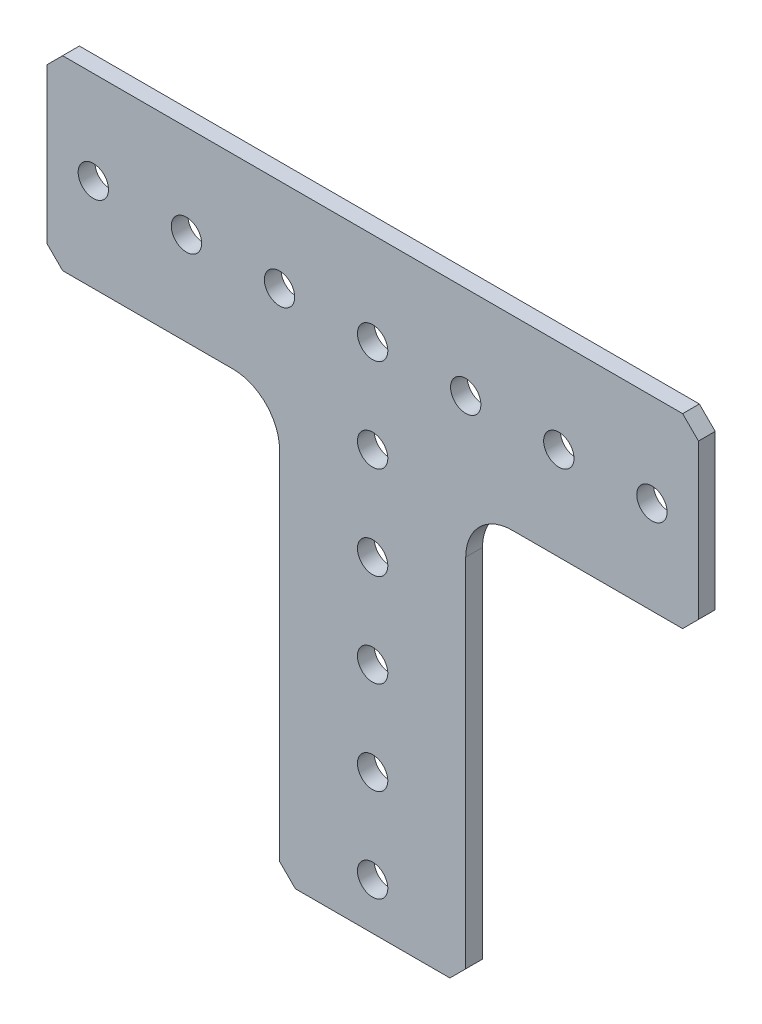
ISO-10303-21;
HEADER;
FILE_DESCRIPTION(('STEP AP214'),'2;1');
FILE_NAME('part.step','',(''),(''),'','','');
FILE_SCHEMA(('AUTOMOTIVE_DESIGN { 1 0 10303 214 1 1 1 1 }'));
ENDSEC;
DATA;
#1=APPLICATION_CONTEXT('core data for automotive mechanical design processes');
#2=APPLICATION_PROTOCOL_DEFINITION('international standard','automotive_design',2000,#1);
#3=PRODUCT_CONTEXT('',#1,'mechanical');
#4=PRODUCT('Part','Part','',(#3));
#5=PRODUCT_RELATED_PRODUCT_CATEGORY('part','',(#4));
#6=PRODUCT_DEFINITION_FORMATION('','',#4);
#7=PRODUCT_DEFINITION_CONTEXT('part definition',#1,'design');
#8=PRODUCT_DEFINITION('design','',#6,#7);
#9=PRODUCT_DEFINITION_SHAPE('','',#8);
#10=(LENGTH_UNIT() NAMED_UNIT(*) SI_UNIT(.MILLI.,.METRE.));
#11=(NAMED_UNIT(*) PLANE_ANGLE_UNIT() SI_UNIT($,.RADIAN.));
#12=(NAMED_UNIT(*) SI_UNIT($,.STERADIAN.) SOLID_ANGLE_UNIT());
#13=UNCERTAINTY_MEASURE_WITH_UNIT(LENGTH_MEASURE(1.E-05),#10,'distance_accuracy_value','');
#14=(GEOMETRIC_REPRESENTATION_CONTEXT(3) GLOBAL_UNCERTAINTY_ASSIGNED_CONTEXT((#13)) GLOBAL_UNIT_ASSIGNED_CONTEXT((#10,
#11,#12)) REPRESENTATION_CONTEXT('',''));
#15=CARTESIAN_POINT('',(0.,0.,0.));
#16=DIRECTION('',(0.,0.,1.));
#17=DIRECTION('',(1.,0.,0.));
#18=AXIS2_PLACEMENT_3D('',#15,#16,#17);
#19=CARTESIAN_POINT('',(44.45,-57.15,2.286));
#20=DIRECTION('',(0.,0.,1.));
#21=DIRECTION('',(1.,0.,0.));
#22=AXIS2_PLACEMENT_3D('',#19,#20,#21);
#23=PLANE('',#22);
#24=CARTESIAN_POINT('',(0.,-38.1,2.286));
#25=DIRECTION('',(0.,0.,-1.));
#26=DIRECTION('',(-1.,0.,0.));
#27=AXIS2_PLACEMENT_3D('',#24,#25,#26);
#28=CIRCLE('',#27,2.0701);
#29=CARTESIAN_POINT('',(-2.0701,-38.1,2.286));
#30=VERTEX_POINT('',#29);
#31=EDGE_CURVE('E222',#30,#30,#28,.T.);
#32=ORIENTED_EDGE('',*,*,#31,.T.);
#33=EDGE_LOOP('',(#32));
#34=FACE_BOUND('',#33,.T.);
#35=CARTESIAN_POINT('',(0.,-12.7,2.286));
#36=DIRECTION('',(0.,0.,-1.));
#37=DIRECTION('',(-1.,0.,0.));
#38=AXIS2_PLACEMENT_3D('',#35,#36,#37);
#39=CIRCLE('',#38,2.0701);
#40=CARTESIAN_POINT('',(-2.0701,-12.7,2.286));
#41=VERTEX_POINT('',#40);
#42=EDGE_CURVE('E321',#41,#41,#39,.T.);
#43=ORIENTED_EDGE('',*,*,#42,.T.);
#44=EDGE_LOOP('',(#43));
#45=FACE_BOUND('',#44,.T.);
#46=CARTESIAN_POINT('',(38.1,12.7,2.286));
#47=DIRECTION('',(0.,0.,-1.));
#48=DIRECTION('',(-1.,0.,0.));
#49=AXIS2_PLACEMENT_3D('',#46,#47,#48);
#50=CIRCLE('',#49,2.0701);
#51=CARTESIAN_POINT('',(36.0299,12.7,2.286));
#52=VERTEX_POINT('',#51);
#53=EDGE_CURVE('E324',#52,#52,#50,.T.);
#54=ORIENTED_EDGE('',*,*,#53,.T.);
#55=EDGE_LOOP('',(#54));
#56=FACE_BOUND('',#55,.T.);
#57=CARTESIAN_POINT('',(12.7,12.7,2.286));
#58=DIRECTION('',(0.,0.,-1.));
#59=DIRECTION('',(-1.,0.,0.));
#60=AXIS2_PLACEMENT_3D('',#57,#58,#59);
#61=CIRCLE('',#60,2.0701);
#62=CARTESIAN_POINT('',(10.6299,12.7,2.286));
#63=VERTEX_POINT('',#62);
#64=EDGE_CURVE('E327',#63,#63,#61,.T.);
#65=ORIENTED_EDGE('',*,*,#64,.T.);
#66=EDGE_LOOP('',(#65));
#67=FACE_BOUND('',#66,.T.);
#68=CARTESIAN_POINT('',(-12.7,12.7,2.286));
#69=DIRECTION('',(0.,0.,-1.));
#70=DIRECTION('',(-1.,0.,0.));
#71=AXIS2_PLACEMENT_3D('',#68,#69,#70);
#72=CIRCLE('',#71,2.0701);
#73=CARTESIAN_POINT('',(-14.7701,12.7,2.286));
#74=VERTEX_POINT('',#73);
#75=EDGE_CURVE('E330',#74,#74,#72,.T.);
#76=ORIENTED_EDGE('',*,*,#75,.T.);
#77=EDGE_LOOP('',(#76));
#78=FACE_BOUND('',#77,.T.);
#79=CARTESIAN_POINT('',(-38.1,12.7,2.286));
#80=DIRECTION('',(0.,0.,-1.));
#81=DIRECTION('',(-1.,0.,0.));
#82=AXIS2_PLACEMENT_3D('',#79,#80,#81);
#83=CIRCLE('',#82,2.0701);
#84=CARTESIAN_POINT('',(-40.1701,12.7,2.286));
#85=VERTEX_POINT('',#84);
#86=EDGE_CURVE('E333',#85,#85,#83,.T.);
#87=ORIENTED_EDGE('',*,*,#86,.T.);
#88=EDGE_LOOP('',(#87));
#89=FACE_BOUND('',#88,.T.);
#90=CARTESIAN_POINT('',(-25.4,12.7,2.286));
#91=DIRECTION('',(0.,0.,-1.));
#92=DIRECTION('',(-1.,0.,0.));
#93=AXIS2_PLACEMENT_3D('',#90,#91,#92);
#94=CIRCLE('',#93,2.0701);
#95=CARTESIAN_POINT('',(-27.4701,12.7,2.286));
#96=VERTEX_POINT('',#95);
#97=EDGE_CURVE('E336',#96,#96,#94,.T.);
#98=ORIENTED_EDGE('',*,*,#97,.T.);
#99=EDGE_LOOP('',(#98));
#100=FACE_BOUND('',#99,.T.);
#101=CARTESIAN_POINT('',(0.,12.7,2.286));
#102=DIRECTION('',(0.,0.,-1.));
#103=DIRECTION('',(-1.,0.,0.));
#104=AXIS2_PLACEMENT_3D('',#101,#102,#103);
#105=CIRCLE('',#104,2.0701);
#106=CARTESIAN_POINT('',(-2.0701,12.7,2.286));
#107=VERTEX_POINT('',#106);
#108=EDGE_CURVE('E339',#107,#107,#105,.T.);
#109=ORIENTED_EDGE('',*,*,#108,.T.);
#110=EDGE_LOOP('',(#109));
#111=FACE_BOUND('',#110,.T.);
#112=CARTESIAN_POINT('',(25.4,12.7,2.286));
#113=DIRECTION('',(0.,0.,-1.));
#114=DIRECTION('',(-1.,0.,0.));
#115=AXIS2_PLACEMENT_3D('',#112,#113,#114);
#116=CIRCLE('',#115,2.0701);
#117=CARTESIAN_POINT('',(23.3299,12.7,2.286));
#118=VERTEX_POINT('',#117);
#119=EDGE_CURVE('E342',#118,#118,#116,.T.);
#120=ORIENTED_EDGE('',*,*,#119,.T.);
#121=EDGE_LOOP('',(#120));
#122=FACE_BOUND('',#121,.T.);
#123=CARTESIAN_POINT('',(0.,0.,2.286));
#124=DIRECTION('',(0.,0.,-1.));
#125=DIRECTION('',(-1.,0.,0.));
#126=AXIS2_PLACEMENT_3D('',#123,#124,#125);
#127=CIRCLE('',#126,2.0701);
#128=CARTESIAN_POINT('',(-2.0701,0.,2.286));
#129=VERTEX_POINT('',#128);
#130=EDGE_CURVE('E345',#129,#129,#127,.T.);
#131=ORIENTED_EDGE('',*,*,#130,.T.);
#132=EDGE_LOOP('',(#131));
#133=FACE_BOUND('',#132,.T.);
#134=CARTESIAN_POINT('',(0.,-25.4,2.286));
#135=DIRECTION('',(0.,0.,-1.));
#136=DIRECTION('',(-1.,0.,0.));
#137=AXIS2_PLACEMENT_3D('',#134,#135,#136);
#138=CIRCLE('',#137,2.0701);
#139=CARTESIAN_POINT('',(-2.0701,-25.4,2.286));
#140=VERTEX_POINT('',#139);
#141=EDGE_CURVE('E347',#140,#140,#138,.T.);
#142=ORIENTED_EDGE('',*,*,#141,.T.);
#143=EDGE_LOOP('',(#142));
#144=FACE_BOUND('',#143,.T.);
#145=CARTESIAN_POINT('',(0.,-50.8,2.286));
#146=DIRECTION('',(0.,0.,-1.));
#147=DIRECTION('',(-1.,0.,0.));
#148=AXIS2_PLACEMENT_3D('',#145,#146,#147);
#149=CIRCLE('',#148,2.0701);
#150=CARTESIAN_POINT('',(-2.07009999999999,-50.8,2.286));
#151=VERTEX_POINT('',#150);
#152=EDGE_CURVE('E20',#151,#151,#149,.T.);
#153=ORIENTED_EDGE('',*,*,#152,.T.);
#154=EDGE_LOOP('',(#153));
#155=FACE_BOUND('',#154,.T.);
#156=DIRECTION('',(0.,1.,0.));
#157=VECTOR('',#156,1.);
#158=CARTESIAN_POINT('',(12.7,0.,2.286));
#159=LINE('',#158,#157);
#160=CARTESIAN_POINT('',(12.7,-54.991,2.286));
#161=VERTEX_POINT('',#160);
#162=CARTESIAN_POINT('',(12.7,-6.34999999999998,2.286));
#163=VERTEX_POINT('',#162);
#164=EDGE_CURVE('E240',#161,#163,#159,.T.);
#165=ORIENTED_EDGE('',*,*,#164,.T.);
#166=CARTESIAN_POINT('',(19.05,-6.34999999999998,2.286));
#167=DIRECTION('',(0.,0.,1.));
#168=DIRECTION('',(1.,0.,0.));
#169=AXIS2_PLACEMENT_3D('',#166,#167,#168);
#170=CIRCLE('',#169,6.35000000000001);
#171=CARTESIAN_POINT('',(19.05,0.,2.286));
#172=VERTEX_POINT('',#171);
#173=EDGE_CURVE('E317',#163,#172,#170,.F.);
#174=ORIENTED_EDGE('',*,*,#173,.T.);
#175=DIRECTION('',(-1.,0.,0.));
#176=VECTOR('',#175,1.);
#177=CARTESIAN_POINT('',(0.,0.,2.286));
#178=LINE('',#177,#176);
#179=CARTESIAN_POINT('',(42.291,0.,2.286));
#180=VERTEX_POINT('',#179);
#181=EDGE_CURVE('E231',#172,#180,#178,.F.);
#182=ORIENTED_EDGE('',*,*,#181,.T.);
#183=DIRECTION('',(-0.707106781186547,-0.707106781186548,0.));
#184=VECTOR('',#183,1.);
#185=CARTESIAN_POINT('',(44.45,2.15900000000001,2.286));
#186=LINE('',#185,#184);
#187=CARTESIAN_POINT('',(44.45,2.15900000000002,2.286));
#188=VERTEX_POINT('',#187);
#189=EDGE_CURVE('E216',#180,#188,#186,.F.);
#190=ORIENTED_EDGE('',*,*,#189,.T.);
#191=DIRECTION('',(0.,1.,0.));
#192=VECTOR('',#191,1.);
#193=CARTESIAN_POINT('',(44.45,25.4,2.286));
#194=LINE('',#193,#192);
#195=CARTESIAN_POINT('',(44.45,23.241,2.286));
#196=VERTEX_POINT('',#195);
#197=EDGE_CURVE('E225',#188,#196,#194,.T.);
#198=ORIENTED_EDGE('',*,*,#197,.T.);
#199=DIRECTION('',(0.707106781186546,-0.707106781186549,0.));
#200=VECTOR('',#199,1.);
#201=CARTESIAN_POINT('',(42.291,25.4,2.286));
#202=LINE('',#201,#200);
#203=CARTESIAN_POINT('',(42.291,25.4,2.286));
#204=VERTEX_POINT('',#203);
#205=EDGE_CURVE('E205',#196,#204,#202,.F.);
#206=ORIENTED_EDGE('',*,*,#205,.T.);
#207=DIRECTION('',(1.,0.,0.));
#208=VECTOR('',#207,1.);
#209=CARTESIAN_POINT('',(-44.45,25.4,2.286));
#210=LINE('',#209,#208);
#211=CARTESIAN_POINT('',(-42.291,25.4,2.286));
#212=VERTEX_POINT('',#211);
#213=EDGE_CURVE('E194',#204,#212,#210,.F.);
#214=ORIENTED_EDGE('',*,*,#213,.T.);
#215=DIRECTION('',(0.707106781186548,0.707106781186548,0.));
#216=VECTOR('',#215,1.);
#217=CARTESIAN_POINT('',(-44.45,23.241,2.286));
#218=LINE('',#217,#216);
#219=CARTESIAN_POINT('',(-44.45,23.241,2.286));
#220=VERTEX_POINT('',#219);
#221=EDGE_CURVE('E183',#212,#220,#218,.F.);
#222=ORIENTED_EDGE('',*,*,#221,.T.);
#223=DIRECTION('',(0.,1.,0.));
#224=VECTOR('',#223,1.);
#225=CARTESIAN_POINT('',(-44.45,25.4,2.286));
#226=LINE('',#225,#224);
#227=CARTESIAN_POINT('',(-44.45,2.15899999999999,2.286));
#228=VERTEX_POINT('',#227);
#229=EDGE_CURVE('E182',#220,#228,#226,.F.);
#230=ORIENTED_EDGE('',*,*,#229,.T.);
#231=DIRECTION('',(0.707106781186547,-0.707106781186548,0.));
#232=VECTOR('',#231,1.);
#233=CARTESIAN_POINT('',(-42.291,0.,2.286));
#234=LINE('',#233,#232);
#235=CARTESIAN_POINT('',(-42.291,0.,2.286));
#236=VERTEX_POINT('',#235);
#237=EDGE_CURVE('E171',#236,#228,#234,.F.);
#238=ORIENTED_EDGE('',*,*,#237,.F.);
#239=DIRECTION('',(1.,0.,0.));
#240=VECTOR('',#239,1.);
#241=CARTESIAN_POINT('',(0.,0.,2.286));
#242=LINE('',#241,#240);
#243=CARTESIAN_POINT('',(-19.05,0.,2.286));
#244=VERTEX_POINT('',#243);
#245=EDGE_CURVE('E127',#244,#236,#242,.F.);
#246=ORIENTED_EDGE('',*,*,#245,.F.);
#247=CARTESIAN_POINT('',(-19.05,-6.34999999999999,2.286));
#248=DIRECTION('',(0.,0.,1.));
#249=DIRECTION('',(1.,0.,0.));
#250=AXIS2_PLACEMENT_3D('',#247,#248,#249);
#251=CIRCLE('',#250,6.35000000000001);
#252=CARTESIAN_POINT('',(-12.7,-6.34999999999998,2.286));
#253=VERTEX_POINT('',#252);
#254=EDGE_CURVE('E140',#244,#253,#251,.F.);
#255=ORIENTED_EDGE('',*,*,#254,.T.);
#256=DIRECTION('',(0.,-1.,0.));
#257=VECTOR('',#256,1.);
#258=CARTESIAN_POINT('',(-12.7,0.,2.286));
#259=LINE('',#258,#257);
#260=CARTESIAN_POINT('',(-12.7,-54.991,2.286));
#261=VERTEX_POINT('',#260);
#262=EDGE_CURVE('E133',#261,#253,#259,.F.);
#263=ORIENTED_EDGE('',*,*,#262,.F.);
#264=DIRECTION('',(0.707106781186547,-0.707106781186548,0.));
#265=VECTOR('',#264,1.);
#266=CARTESIAN_POINT('',(-10.541,-57.15,2.286));
#267=LINE('',#266,#265);
#268=CARTESIAN_POINT('',(-10.541,-57.15,2.286));
#269=VERTEX_POINT('',#268);
#270=EDGE_CURVE('E150',#269,#261,#267,.F.);
#271=ORIENTED_EDGE('',*,*,#270,.F.);
#272=DIRECTION('',(1.,0.,0.));
#273=VECTOR('',#272,1.);
#274=CARTESIAN_POINT('',(-12.7,-57.15,2.286));
#275=LINE('',#274,#273);
#276=CARTESIAN_POINT('',(10.541,-57.15,2.286));
#277=VERTEX_POINT('',#276);
#278=EDGE_CURVE('E251',#269,#277,#275,.T.);
#279=ORIENTED_EDGE('',*,*,#278,.T.);
#280=DIRECTION('',(-0.707106781186547,-0.707106781186548,0.));
#281=VECTOR('',#280,1.);
#282=CARTESIAN_POINT('',(12.7,-54.991,2.286));
#283=LINE('',#282,#281);
#284=EDGE_CURVE('E246',#277,#161,#283,.F.);
#285=ORIENTED_EDGE('',*,*,#284,.T.);
#286=EDGE_LOOP('',(#165,#174,#182,#190,#198,#206,#214,#222,#230,#238,#246,#255,#263,#271,#279,#285));
#287=FACE_BOUND('',#286,.T.);
#288=ADVANCED_FACE('F17',(#34,#45,#56,#67,#78,#89,#100,#111,#122,#133,#144,#155,#287),#23,.T.);
#289=CARTESIAN_POINT('',(0.,-50.8,2.286));
#290=DIRECTION('',(0.,0.,-1.));
#291=DIRECTION('',(-1.,0.,0.));
#292=AXIS2_PLACEMENT_3D('',#289,#290,#291);
#293=CYLINDRICAL_SURFACE('',#292,2.0701);
#294=CARTESIAN_POINT('',(0.,-50.8,0.));
#295=DIRECTION('',(0.,0.,-1.));
#296=DIRECTION('',(-1.,0.,0.));
#297=AXIS2_PLACEMENT_3D('',#294,#295,#296);
#298=CIRCLE('',#297,2.0701);
#299=CARTESIAN_POINT('',(-2.07009999999999,-50.8,0.));
#300=VERTEX_POINT('',#299);
#301=EDGE_CURVE('E228',#300,#300,#298,.T.);
#302=ORIENTED_EDGE('',*,*,#301,.T.);
#303=EDGE_LOOP('',(#302));
#304=FACE_BOUND('',#303,.T.);
#305=ORIENTED_EDGE('',*,*,#152,.F.);
#306=EDGE_LOOP('',(#305));
#307=FACE_BOUND('',#306,.T.);
#308=ADVANCED_FACE('F355',(#304,#307),#293,.F.);
#309=CARTESIAN_POINT('',(0.,-25.4,2.286));
#310=DIRECTION('',(0.,0.,-1.));
#311=DIRECTION('',(-1.,0.,0.));
#312=AXIS2_PLACEMENT_3D('',#309,#310,#311);
#313=CYLINDRICAL_SURFACE('',#312,2.0701);
#314=CARTESIAN_POINT('',(0.,-25.4,0.));
#315=DIRECTION('',(0.,0.,-1.));
#316=DIRECTION('',(-1.,0.,0.));
#317=AXIS2_PLACEMENT_3D('',#314,#315,#316);
#318=CIRCLE('',#317,2.0701);
#319=CARTESIAN_POINT('',(-2.0701,-25.4,0.));
#320=VERTEX_POINT('',#319);
#321=EDGE_CURVE('E312',#320,#320,#318,.T.);
#322=ORIENTED_EDGE('',*,*,#321,.T.);
#323=EDGE_LOOP('',(#322));
#324=FACE_BOUND('',#323,.T.);
#325=ORIENTED_EDGE('',*,*,#141,.F.);
#326=EDGE_LOOP('',(#325));
#327=FACE_BOUND('',#326,.T.);
#328=ADVANCED_FACE('F357',(#324,#327),#313,.F.);
#329=CARTESIAN_POINT('',(0.,0.,2.286));
#330=DIRECTION('',(0.,0.,-1.));
#331=DIRECTION('',(-1.,0.,0.));
#332=AXIS2_PLACEMENT_3D('',#329,#330,#331);
#333=CYLINDRICAL_SURFACE('',#332,2.0701);
#334=CARTESIAN_POINT('',(0.,0.,0.));
#335=DIRECTION('',(0.,0.,-1.));
#336=DIRECTION('',(-1.,0.,0.));
#337=AXIS2_PLACEMENT_3D('',#334,#335,#336);
#338=CIRCLE('',#337,2.0701);
#339=CARTESIAN_POINT('',(-2.0701,0.,0.));
#340=VERTEX_POINT('',#339);
#341=EDGE_CURVE('E309',#340,#340,#338,.T.);
#342=ORIENTED_EDGE('',*,*,#341,.T.);
#343=EDGE_LOOP('',(#342));
#344=FACE_BOUND('',#343,.T.);
#345=ORIENTED_EDGE('',*,*,#130,.F.);
#346=EDGE_LOOP('',(#345));
#347=FACE_BOUND('',#346,.T.);
#348=ADVANCED_FACE('F364',(#344,#347),#333,.F.);
#349=CARTESIAN_POINT('',(25.4,12.7,2.286));
#350=DIRECTION('',(0.,0.,-1.));
#351=DIRECTION('',(-1.,0.,0.));
#352=AXIS2_PLACEMENT_3D('',#349,#350,#351);
#353=CYLINDRICAL_SURFACE('',#352,2.0701);
#354=CARTESIAN_POINT('',(25.4,12.7,0.));
#355=DIRECTION('',(0.,0.,-1.));
#356=DIRECTION('',(-1.,0.,0.));
#357=AXIS2_PLACEMENT_3D('',#354,#355,#356);
#358=CIRCLE('',#357,2.0701);
#359=CARTESIAN_POINT('',(23.3299,12.7,0.));
#360=VERTEX_POINT('',#359);
#361=EDGE_CURVE('E306',#360,#360,#358,.T.);
#362=ORIENTED_EDGE('',*,*,#361,.T.);
#363=EDGE_LOOP('',(#362));
#364=FACE_BOUND('',#363,.T.);
#365=ORIENTED_EDGE('',*,*,#119,.F.);
#366=EDGE_LOOP('',(#365));
#367=FACE_BOUND('',#366,.T.);
#368=ADVANCED_FACE('F467',(#364,#367),#353,.F.);
#369=CARTESIAN_POINT('',(0.,12.7,2.286));
#370=DIRECTION('',(0.,0.,-1.));
#371=DIRECTION('',(-1.,0.,0.));
#372=AXIS2_PLACEMENT_3D('',#369,#370,#371);
#373=CYLINDRICAL_SURFACE('',#372,2.0701);
#374=CARTESIAN_POINT('',(0.,12.7,0.));
#375=DIRECTION('',(0.,0.,-1.));
#376=DIRECTION('',(-1.,0.,0.));
#377=AXIS2_PLACEMENT_3D('',#374,#375,#376);
#378=CIRCLE('',#377,2.0701);
#379=CARTESIAN_POINT('',(-2.0701,12.7,0.));
#380=VERTEX_POINT('',#379);
#381=EDGE_CURVE('E303',#380,#380,#378,.T.);
#382=ORIENTED_EDGE('',*,*,#381,.T.);
#383=EDGE_LOOP('',(#382));
#384=FACE_BOUND('',#383,.T.);
#385=ORIENTED_EDGE('',*,*,#108,.F.);
#386=EDGE_LOOP('',(#385));
#387=FACE_BOUND('',#386,.T.);
#388=ADVANCED_FACE('F463',(#384,#387),#373,.F.);
#389=CARTESIAN_POINT('',(-25.4,12.7,2.286));
#390=DIRECTION('',(0.,0.,-1.));
#391=DIRECTION('',(-1.,0.,0.));
#392=AXIS2_PLACEMENT_3D('',#389,#390,#391);
#393=CYLINDRICAL_SURFACE('',#392,2.0701);
#394=CARTESIAN_POINT('',(-25.4,12.7,0.));
#395=DIRECTION('',(0.,0.,-1.));
#396=DIRECTION('',(-1.,0.,0.));
#397=AXIS2_PLACEMENT_3D('',#394,#395,#396);
#398=CIRCLE('',#397,2.0701);
#399=CARTESIAN_POINT('',(-27.4701,12.7,0.));
#400=VERTEX_POINT('',#399);
#401=EDGE_CURVE('E300',#400,#400,#398,.T.);
#402=ORIENTED_EDGE('',*,*,#401,.T.);
#403=EDGE_LOOP('',(#402));
#404=FACE_BOUND('',#403,.T.);
#405=ORIENTED_EDGE('',*,*,#97,.F.);
#406=EDGE_LOOP('',(#405));
#407=FACE_BOUND('',#406,.T.);
#408=ADVANCED_FACE('F459',(#404,#407),#393,.F.);
#409=CARTESIAN_POINT('',(-38.1,12.7,2.286));
#410=DIRECTION('',(0.,0.,-1.));
#411=DIRECTION('',(-1.,0.,0.));
#412=AXIS2_PLACEMENT_3D('',#409,#410,#411);
#413=CYLINDRICAL_SURFACE('',#412,2.0701);
#414=CARTESIAN_POINT('',(-38.1,12.7,0.));
#415=DIRECTION('',(0.,0.,-1.));
#416=DIRECTION('',(-1.,0.,0.));
#417=AXIS2_PLACEMENT_3D('',#414,#415,#416);
#418=CIRCLE('',#417,2.0701);
#419=CARTESIAN_POINT('',(-40.1701,12.7,0.));
#420=VERTEX_POINT('',#419);
#421=EDGE_CURVE('E297',#420,#420,#418,.T.);
#422=ORIENTED_EDGE('',*,*,#421,.T.);
#423=EDGE_LOOP('',(#422));
#424=FACE_BOUND('',#423,.T.);
#425=ORIENTED_EDGE('',*,*,#86,.F.);
#426=EDGE_LOOP('',(#425));
#427=FACE_BOUND('',#426,.T.);
#428=ADVANCED_FACE('F455',(#424,#427),#413,.F.);
#429=CARTESIAN_POINT('',(-12.7,12.7,2.286));
#430=DIRECTION('',(0.,0.,-1.));
#431=DIRECTION('',(-1.,0.,0.));
#432=AXIS2_PLACEMENT_3D('',#429,#430,#431);
#433=CYLINDRICAL_SURFACE('',#432,2.0701);
#434=CARTESIAN_POINT('',(-12.7,12.7,0.));
#435=DIRECTION('',(0.,0.,-1.));
#436=DIRECTION('',(-1.,0.,0.));
#437=AXIS2_PLACEMENT_3D('',#434,#435,#436);
#438=CIRCLE('',#437,2.0701);
#439=CARTESIAN_POINT('',(-14.7701,12.7,0.));
#440=VERTEX_POINT('',#439);
#441=EDGE_CURVE('E294',#440,#440,#438,.T.);
#442=ORIENTED_EDGE('',*,*,#441,.T.);
#443=EDGE_LOOP('',(#442));
#444=FACE_BOUND('',#443,.T.);
#445=ORIENTED_EDGE('',*,*,#75,.F.);
#446=EDGE_LOOP('',(#445));
#447=FACE_BOUND('',#446,.T.);
#448=ADVANCED_FACE('F451',(#444,#447),#433,.F.);
#449=CARTESIAN_POINT('',(12.7,12.7,2.286));
#450=DIRECTION('',(0.,0.,-1.));
#451=DIRECTION('',(-1.,0.,0.));
#452=AXIS2_PLACEMENT_3D('',#449,#450,#451);
#453=CYLINDRICAL_SURFACE('',#452,2.0701);
#454=CARTESIAN_POINT('',(12.7,12.7,0.));
#455=DIRECTION('',(0.,0.,-1.));
#456=DIRECTION('',(-1.,0.,0.));
#457=AXIS2_PLACEMENT_3D('',#454,#455,#456);
#458=CIRCLE('',#457,2.0701);
#459=CARTESIAN_POINT('',(10.6299,12.7,0.));
#460=VERTEX_POINT('',#459);
#461=EDGE_CURVE('E291',#460,#460,#458,.T.);
#462=ORIENTED_EDGE('',*,*,#461,.T.);
#463=EDGE_LOOP('',(#462));
#464=FACE_BOUND('',#463,.T.);
#465=ORIENTED_EDGE('',*,*,#64,.F.);
#466=EDGE_LOOP('',(#465));
#467=FACE_BOUND('',#466,.T.);
#468=ADVANCED_FACE('F447',(#464,#467),#453,.F.);
#469=CARTESIAN_POINT('',(38.1,12.7,2.286));
#470=DIRECTION('',(0.,0.,-1.));
#471=DIRECTION('',(-1.,0.,0.));
#472=AXIS2_PLACEMENT_3D('',#469,#470,#471);
#473=CYLINDRICAL_SURFACE('',#472,2.0701);
#474=CARTESIAN_POINT('',(38.1,12.7,0.));
#475=DIRECTION('',(0.,0.,-1.));
#476=DIRECTION('',(-1.,0.,0.));
#477=AXIS2_PLACEMENT_3D('',#474,#475,#476);
#478=CIRCLE('',#477,2.0701);
#479=CARTESIAN_POINT('',(36.0299,12.7,0.));
#480=VERTEX_POINT('',#479);
#481=EDGE_CURVE('E288',#480,#480,#478,.T.);
#482=ORIENTED_EDGE('',*,*,#481,.T.);
#483=EDGE_LOOP('',(#482));
#484=FACE_BOUND('',#483,.T.);
#485=ORIENTED_EDGE('',*,*,#53,.F.);
#486=EDGE_LOOP('',(#485));
#487=FACE_BOUND('',#486,.T.);
#488=ADVANCED_FACE('F443',(#484,#487),#473,.F.);
#489=CARTESIAN_POINT('',(0.,-12.7,2.286));
#490=DIRECTION('',(0.,0.,-1.));
#491=DIRECTION('',(-1.,0.,0.));
#492=AXIS2_PLACEMENT_3D('',#489,#490,#491);
#493=CYLINDRICAL_SURFACE('',#492,2.0701);
#494=CARTESIAN_POINT('',(0.,-12.7,0.));
#495=DIRECTION('',(0.,0.,-1.));
#496=DIRECTION('',(-1.,0.,0.));
#497=AXIS2_PLACEMENT_3D('',#494,#495,#496);
#498=CIRCLE('',#497,2.0701);
#499=CARTESIAN_POINT('',(-2.0701,-12.7,0.));
#500=VERTEX_POINT('',#499);
#501=EDGE_CURVE('E285',#500,#500,#498,.T.);
#502=ORIENTED_EDGE('',*,*,#501,.T.);
#503=EDGE_LOOP('',(#502));
#504=FACE_BOUND('',#503,.T.);
#505=ORIENTED_EDGE('',*,*,#42,.F.);
#506=EDGE_LOOP('',(#505));
#507=FACE_BOUND('',#506,.T.);
#508=ADVANCED_FACE('F439',(#504,#507),#493,.F.);
#509=CARTESIAN_POINT('',(0.,-38.1,2.286));
#510=DIRECTION('',(0.,0.,-1.));
#511=DIRECTION('',(-1.,0.,0.));
#512=AXIS2_PLACEMENT_3D('',#509,#510,#511);
#513=CYLINDRICAL_SURFACE('',#512,2.0701);
#514=CARTESIAN_POINT('',(0.,-38.1,0.));
#515=DIRECTION('',(0.,0.,-1.));
#516=DIRECTION('',(-1.,0.,0.));
#517=AXIS2_PLACEMENT_3D('',#514,#515,#516);
#518=CIRCLE('',#517,2.0701);
#519=CARTESIAN_POINT('',(-2.0701,-38.1,0.));
#520=VERTEX_POINT('',#519);
#521=EDGE_CURVE('E210',#520,#520,#518,.T.);
#522=ORIENTED_EDGE('',*,*,#521,.T.);
#523=EDGE_LOOP('',(#522));
#524=FACE_BOUND('',#523,.T.);
#525=ORIENTED_EDGE('',*,*,#31,.F.);
#526=EDGE_LOOP('',(#525));
#527=FACE_BOUND('',#526,.T.);
#528=ADVANCED_FACE('F435',(#524,#527),#513,.F.);
#529=CARTESIAN_POINT('',(42.291,25.4,2.286));
#530=DIRECTION('',(-0.707106781186549,-0.707106781186546,0.));
#531=DIRECTION('',(0.707106781186546,-0.707106781186549,0.));
#532=AXIS2_PLACEMENT_3D('',#529,#530,#531);
#533=PLANE('',#532);
#534=DIRECTION('',(0.,0.,1.));
#535=VECTOR('',#534,1.);
#536=CARTESIAN_POINT('',(44.45,23.241,2.286));
#537=LINE('',#536,#535);
#538=CARTESIAN_POINT('',(44.45,23.241,0.));
#539=VERTEX_POINT('',#538);
#540=EDGE_CURVE('E213',#196,#539,#537,.F.);
#541=ORIENTED_EDGE('',*,*,#540,.T.);
#542=DIRECTION('',(-0.707106781186551,0.707106781186544,0.));
#543=VECTOR('',#542,1.);
#544=CARTESIAN_POINT('',(44.45,23.241,0.));
#545=LINE('',#544,#543);
#546=CARTESIAN_POINT('',(42.291,25.4,0.));
#547=VERTEX_POINT('',#546);
#548=EDGE_CURVE('E199',#539,#547,#545,.T.);
#549=ORIENTED_EDGE('',*,*,#548,.T.);
#550=DIRECTION('',(0.,0.,-1.));
#551=VECTOR('',#550,1.);
#552=CARTESIAN_POINT('',(42.291,25.4,2.286));
#553=LINE('',#552,#551);
#554=EDGE_CURVE('E202',#547,#204,#553,.F.);
#555=ORIENTED_EDGE('',*,*,#554,.T.);
#556=ORIENTED_EDGE('',*,*,#205,.F.);
#557=EDGE_LOOP('',(#541,#549,#555,#556));
#558=FACE_BOUND('',#557,.T.);
#559=ADVANCED_FACE('F431',(#558),#533,.F.);
#560=CARTESIAN_POINT('',(-44.45,25.4,2.286));
#561=DIRECTION('',(0.,-1.,0.));
#562=DIRECTION('',(0.,0.,-1.));
#563=AXIS2_PLACEMENT_3D('',#560,#561,#562);
#564=PLANE('',#563);
#565=DIRECTION('',(0.,0.,1.));
#566=VECTOR('',#565,1.);
#567=CARTESIAN_POINT('',(-42.291,25.4,2.286));
#568=LINE('',#567,#566);
#569=CARTESIAN_POINT('',(-42.291,25.4,0.));
#570=VERTEX_POINT('',#569);
#571=EDGE_CURVE('E191',#570,#212,#568,.T.);
#572=ORIENTED_EDGE('',*,*,#571,.T.);
#573=ORIENTED_EDGE('',*,*,#213,.F.);
#574=ORIENTED_EDGE('',*,*,#554,.F.);
#575=DIRECTION('',(1.,0.,0.));
#576=VECTOR('',#575,1.);
#577=CARTESIAN_POINT('',(44.45,25.4,0.));
#578=LINE('',#577,#576);
#579=EDGE_CURVE('E188',#547,#570,#578,.F.);
#580=ORIENTED_EDGE('',*,*,#579,.T.);
#581=EDGE_LOOP('',(#572,#573,#574,#580));
#582=FACE_BOUND('',#581,.T.);
#583=ADVANCED_FACE('F427',(#582),#564,.F.);
#584=CARTESIAN_POINT('',(-44.45,23.241,2.286));
#585=DIRECTION('',(0.707106781186548,-0.707106781186548,0.));
#586=DIRECTION('',(0.707106781186548,0.707106781186548,0.));
#587=AXIS2_PLACEMENT_3D('',#584,#585,#586);
#588=PLANE('',#587);
#589=ORIENTED_EDGE('',*,*,#571,.F.);
#590=DIRECTION('',(-0.707106781186548,-0.707106781186548,0.));
#591=VECTOR('',#590,1.);
#592=CARTESIAN_POINT('',(-42.291,25.4,0.));
#593=LINE('',#592,#591);
#594=CARTESIAN_POINT('',(-44.45,23.241,0.));
#595=VERTEX_POINT('',#594);
#596=EDGE_CURVE('E176',#570,#595,#593,.T.);
#597=ORIENTED_EDGE('',*,*,#596,.T.);
#598=DIRECTION('',(0.,0.,-1.));
#599=VECTOR('',#598,1.);
#600=CARTESIAN_POINT('',(-44.45,23.241,2.286));
#601=LINE('',#600,#599);
#602=EDGE_CURVE('E179',#595,#220,#601,.F.);
#603=ORIENTED_EDGE('',*,*,#602,.T.);
#604=ORIENTED_EDGE('',*,*,#221,.F.);
#605=EDGE_LOOP('',(#589,#597,#603,#604));
#606=FACE_BOUND('',#605,.T.);
#607=ADVANCED_FACE('F423',(#606),#588,.F.);
#608=CARTESIAN_POINT('',(-44.45,25.4,2.286));
#609=DIRECTION('',(1.,0.,0.));
#610=DIRECTION('',(0.,0.,-1.));
#611=AXIS2_PLACEMENT_3D('',#608,#609,#610);
#612=PLANE('',#611);
#613=DIRECTION('',(0.,0.,1.));
#614=VECTOR('',#613,1.);
#615=CARTESIAN_POINT('',(-44.45,2.15899999999999,0.));
#616=LINE('',#615,#614);
#617=CARTESIAN_POINT('',(-44.45,2.159,0.));
#618=VERTEX_POINT('',#617);
#619=EDGE_CURVE('E169',#228,#618,#616,.F.);
#620=ORIENTED_EDGE('',*,*,#619,.F.);
#621=ORIENTED_EDGE('',*,*,#229,.F.);
#622=ORIENTED_EDGE('',*,*,#602,.F.);
#623=DIRECTION('',(0.,1.,0.));
#624=VECTOR('',#623,1.);
#625=CARTESIAN_POINT('',(-44.45,-57.15,0.));
#626=LINE('',#625,#624);
#627=EDGE_CURVE('E166',#595,#618,#626,.F.);
#628=ORIENTED_EDGE('',*,*,#627,.T.);
#629=EDGE_LOOP('',(#620,#621,#622,#628));
#630=FACE_BOUND('',#629,.T.);
#631=ADVANCED_FACE('F419',(#630),#612,.F.);
#632=CARTESIAN_POINT('',(-42.291,0.,0.));
#633=DIRECTION('',(-0.707106781186548,-0.707106781186547,0.));
#634=DIRECTION('',(0.707106781186547,-0.707106781186548,0.));
#635=AXIS2_PLACEMENT_3D('',#632,#633,#634);
#636=PLANE('',#635);
#637=DIRECTION('',(0.707106781186546,-0.707106781186549,0.));
#638=VECTOR('',#637,1.);
#639=CARTESIAN_POINT('',(-44.45,2.159,0.));
#640=LINE('',#639,#638);
#641=CARTESIAN_POINT('',(-42.291,0.,0.));
#642=VERTEX_POINT('',#641);
#643=EDGE_CURVE('E162',#618,#642,#640,.T.);
#644=ORIENTED_EDGE('',*,*,#643,.T.);
#645=DIRECTION('',(0.,0.,1.));
#646=VECTOR('',#645,1.);
#647=CARTESIAN_POINT('',(-42.291,0.,0.));
#648=LINE('',#647,#646);
#649=EDGE_CURVE('E158',#236,#642,#648,.F.);
#650=ORIENTED_EDGE('',*,*,#649,.F.);
#651=ORIENTED_EDGE('',*,*,#237,.T.);
#652=ORIENTED_EDGE('',*,*,#619,.T.);
#653=EDGE_LOOP('',(#644,#650,#651,#652));
#654=FACE_BOUND('',#653,.T.);
#655=ADVANCED_FACE('F415',(#654),#636,.T.);
#656=CARTESIAN_POINT('',(0.,0.,0.));
#657=DIRECTION('',(0.,-1.,0.));
#658=DIRECTION('',(1.,0.,0.));
#659=AXIS2_PLACEMENT_3D('',#656,#657,#658);
#660=PLANE('',#659);
#661=DIRECTION('',(1.,0.,0.));
#662=VECTOR('',#661,1.);
#663=CARTESIAN_POINT('',(44.45,0.,0.));
#664=LINE('',#663,#662);
#665=CARTESIAN_POINT('',(-19.05,0.,0.));
#666=VERTEX_POINT('',#665);
#667=EDGE_CURVE('E165',#642,#666,#664,.T.);
#668=ORIENTED_EDGE('',*,*,#667,.T.);
#669=DIRECTION('',(0.,0.,1.));
#670=VECTOR('',#669,1.);
#671=CARTESIAN_POINT('',(-19.05,0.,0.));
#672=LINE('',#671,#670);
#673=EDGE_CURVE('E144',#666,#244,#672,.T.);
#674=ORIENTED_EDGE('',*,*,#673,.T.);
#675=ORIENTED_EDGE('',*,*,#245,.T.);
#676=ORIENTED_EDGE('',*,*,#649,.T.);
#677=EDGE_LOOP('',(#668,#674,#675,#676));
#678=FACE_BOUND('',#677,.T.);
#679=ADVANCED_FACE('F412',(#678),#660,.T.);
#680=CARTESIAN_POINT('',(-19.05,-6.34999999999999,0.));
#681=DIRECTION('',(0.,0.,1.));
#682=DIRECTION('',(1.,0.,0.));
#683=AXIS2_PLACEMENT_3D('',#680,#681,#682);
#684=CYLINDRICAL_SURFACE('',#683,6.35000000000001);
#685=ORIENTED_EDGE('',*,*,#673,.F.);
#686=CARTESIAN_POINT('',(-19.05,-6.34999999999999,0.));
#687=DIRECTION('',(0.,0.,1.));
#688=DIRECTION('',(1.,0.,0.));
#689=AXIS2_PLACEMENT_3D('',#686,#687,#688);
#690=CIRCLE('',#689,6.35000000000001);
#691=CARTESIAN_POINT('',(-12.7,-6.34999999999999,0.));
#692=VERTEX_POINT('',#691);
#693=EDGE_CURVE('E149',#666,#692,#690,.F.);
#694=ORIENTED_EDGE('',*,*,#693,.T.);
#695=DIRECTION('',(0.,0.,1.));
#696=VECTOR('',#695,1.);
#697=CARTESIAN_POINT('',(-12.7,-6.34999999999999,0.));
#698=LINE('',#697,#696);
#699=EDGE_CURVE('E137',#253,#692,#698,.F.);
#700=ORIENTED_EDGE('',*,*,#699,.F.);
#701=ORIENTED_EDGE('',*,*,#254,.F.);
#702=EDGE_LOOP('',(#685,#694,#700,#701));
#703=FACE_BOUND('',#702,.T.);
#704=ADVANCED_FACE('F147',(#703),#684,.F.);
#705=CARTESIAN_POINT('',(-12.7,0.,0.));
#706=DIRECTION('',(-1.,0.,0.));
#707=DIRECTION('',(0.,-1.,0.));
#708=AXIS2_PLACEMENT_3D('',#705,#706,#707);
#709=PLANE('',#708);
#710=ORIENTED_EDGE('',*,*,#262,.T.);
#711=ORIENTED_EDGE('',*,*,#699,.T.);
#712=DIRECTION('',(0.,1.,0.));
#713=VECTOR('',#712,1.);
#714=CARTESIAN_POINT('',(-12.7,-57.15,0.));
#715=LINE('',#714,#713);
#716=CARTESIAN_POINT('',(-12.7,-54.991,0.));
#717=VERTEX_POINT('',#716);
#718=EDGE_CURVE('E282',#692,#717,#715,.F.);
#719=ORIENTED_EDGE('',*,*,#718,.T.);
#720=DIRECTION('',(0.,0.,1.));
#721=VECTOR('',#720,1.);
#722=CARTESIAN_POINT('',(-12.7,-54.991,2.286));
#723=LINE('',#722,#721);
#724=EDGE_CURVE('E139',#261,#717,#723,.F.);
#725=ORIENTED_EDGE('',*,*,#724,.F.);
#726=EDGE_LOOP('',(#710,#711,#719,#725));
#727=FACE_BOUND('',#726,.T.);
#728=ADVANCED_FACE('F134',(#727),#709,.T.);
#729=CARTESIAN_POINT('',(-10.541,-57.15,2.286));
#730=DIRECTION('',(-0.707106781186548,-0.707106781186547,0.));
#731=DIRECTION('',(0.707106781186547,-0.707106781186548,0.));
#732=AXIS2_PLACEMENT_3D('',#729,#730,#731);
#733=PLANE('',#732);
#734=DIRECTION('',(0.707106781186547,-0.707106781186547,0.));
#735=VECTOR('',#734,1.);
#736=CARTESIAN_POINT('',(-12.7,-54.991,0.));
#737=LINE('',#736,#735);
#738=CARTESIAN_POINT('',(-10.541,-57.15,0.));
#739=VERTEX_POINT('',#738);
#740=EDGE_CURVE('E748',#717,#739,#737,.T.);
#741=ORIENTED_EDGE('',*,*,#740,.T.);
#742=DIRECTION('',(0.,0.,1.));
#743=VECTOR('',#742,1.);
#744=CARTESIAN_POINT('',(-10.541,-57.15,2.286));
#745=LINE('',#744,#743);
#746=EDGE_CURVE('E253',#739,#269,#745,.T.);
#747=ORIENTED_EDGE('',*,*,#746,.T.);
#748=ORIENTED_EDGE('',*,*,#270,.T.);
#749=ORIENTED_EDGE('',*,*,#724,.T.);
#750=EDGE_LOOP('',(#741,#747,#748,#749));
#751=FACE_BOUND('',#750,.T.);
#752=ADVANCED_FACE('F403',(#751),#733,.T.);
#753=CARTESIAN_POINT('',(-12.7,-57.15,2.286));
#754=DIRECTION('',(0.,1.,0.));
#755=DIRECTION('',(0.,0.,1.));
#756=AXIS2_PLACEMENT_3D('',#753,#754,#755);
#757=PLANE('',#756);
#758=ORIENTED_EDGE('',*,*,#746,.F.);
#759=DIRECTION('',(1.,0.,0.));
#760=VECTOR('',#759,1.);
#761=CARTESIAN_POINT('',(44.45,-57.15,0.));
#762=LINE('',#761,#760);
#763=CARTESIAN_POINT('',(10.541,-57.15,0.));
#764=VERTEX_POINT('',#763);
#765=EDGE_CURVE('E739',#739,#764,#762,.T.);
#766=ORIENTED_EDGE('',*,*,#765,.T.);
#767=DIRECTION('',(0.,0.,1.));
#768=VECTOR('',#767,1.);
#769=CARTESIAN_POINT('',(10.541,-57.15,0.));
#770=LINE('',#769,#768);
#771=EDGE_CURVE('E248',#764,#277,#770,.T.);
#772=ORIENTED_EDGE('',*,*,#771,.T.);
#773=ORIENTED_EDGE('',*,*,#278,.F.);
#774=EDGE_LOOP('',(#758,#766,#772,#773));
#775=FACE_BOUND('',#774,.T.);
#776=ADVANCED_FACE('F399',(#775),#757,.F.);
#777=CARTESIAN_POINT('',(12.7,-54.991,0.));
#778=DIRECTION('',(-0.707106781186548,0.707106781186547,0.));
#779=DIRECTION('',(-0.707106781186547,-0.707106781186548,0.));
#780=AXIS2_PLACEMENT_3D('',#777,#778,#779);
#781=PLANE('',#780);
#782=ORIENTED_EDGE('',*,*,#771,.F.);
#783=DIRECTION('',(0.707106781186547,0.707106781186547,0.));
#784=VECTOR('',#783,1.);
#785=CARTESIAN_POINT('',(10.541,-57.15,0.));
#786=LINE('',#785,#784);
#787=CARTESIAN_POINT('',(12.7,-54.991,0.));
#788=VERTEX_POINT('',#787);
#789=EDGE_CURVE('E736',#764,#788,#786,.T.);
#790=ORIENTED_EDGE('',*,*,#789,.T.);
#791=DIRECTION('',(0.,0.,1.));
#792=VECTOR('',#791,1.);
#793=CARTESIAN_POINT('',(12.7,-54.991,0.));
#794=LINE('',#793,#792);
#795=EDGE_CURVE('E243',#788,#161,#794,.T.);
#796=ORIENTED_EDGE('',*,*,#795,.T.);
#797=ORIENTED_EDGE('',*,*,#284,.F.);
#798=EDGE_LOOP('',(#782,#790,#796,#797));
#799=FACE_BOUND('',#798,.T.);
#800=ADVANCED_FACE('F395',(#799),#781,.F.);
#801=CARTESIAN_POINT('',(12.7,0.,0.));
#802=DIRECTION('',(-1.,0.,0.));
#803=DIRECTION('',(0.,0.,1.));
#804=AXIS2_PLACEMENT_3D('',#801,#802,#803);
#805=PLANE('',#804);
#806=ORIENTED_EDGE('',*,*,#795,.F.);
#807=DIRECTION('',(0.,1.,0.));
#808=VECTOR('',#807,1.);
#809=CARTESIAN_POINT('',(12.7,-57.15,0.));
#810=LINE('',#809,#808);
#811=CARTESIAN_POINT('',(12.7,-6.34999999999998,0.));
#812=VERTEX_POINT('',#811);
#813=EDGE_CURVE('E280',#788,#812,#810,.T.);
#814=ORIENTED_EDGE('',*,*,#813,.T.);
#815=DIRECTION('',(0.,0.,1.));
#816=VECTOR('',#815,1.);
#817=CARTESIAN_POINT('',(12.7,-6.34999999999998,0.));
#818=LINE('',#817,#816);
#819=EDGE_CURVE('E242',#812,#163,#818,.T.);
#820=ORIENTED_EDGE('',*,*,#819,.T.);
#821=ORIENTED_EDGE('',*,*,#164,.F.);
#822=EDGE_LOOP('',(#806,#814,#820,#821));
#823=FACE_BOUND('',#822,.T.);
#824=ADVANCED_FACE('F391',(#823),#805,.F.);
#825=CARTESIAN_POINT('',(19.05,-6.34999999999998,0.));
#826=DIRECTION('',(0.,0.,1.));
#827=DIRECTION('',(1.,0.,0.));
#828=AXIS2_PLACEMENT_3D('',#825,#826,#827);
#829=CYLINDRICAL_SURFACE('',#828,6.35000000000001);
#830=ORIENTED_EDGE('',*,*,#819,.F.);
#831=CARTESIAN_POINT('',(19.05,-6.34999999999998,0.));
#832=DIRECTION('',(0.,0.,1.));
#833=DIRECTION('',(1.,0.,0.));
#834=AXIS2_PLACEMENT_3D('',#831,#832,#833);
#835=CIRCLE('',#834,6.35000000000001);
#836=CARTESIAN_POINT('',(19.05,0.,0.));
#837=VERTEX_POINT('',#836);
#838=EDGE_CURVE('E276',#812,#837,#835,.F.);
#839=ORIENTED_EDGE('',*,*,#838,.T.);
#840=DIRECTION('',(0.,0.,1.));
#841=VECTOR('',#840,1.);
#842=CARTESIAN_POINT('',(19.05,0.,0.));
#843=LINE('',#842,#841);
#844=EDGE_CURVE('E234',#837,#172,#843,.T.);
#845=ORIENTED_EDGE('',*,*,#844,.T.);
#846=ORIENTED_EDGE('',*,*,#173,.F.);
#847=EDGE_LOOP('',(#830,#839,#845,#846));
#848=FACE_BOUND('',#847,.T.);
#849=ADVANCED_FACE('F387',(#848),#829,.F.);
#850=CARTESIAN_POINT('',(0.,0.,0.));
#851=DIRECTION('',(0.,1.,0.));
#852=DIRECTION('',(-1.,0.,0.));
#853=AXIS2_PLACEMENT_3D('',#850,#851,#852);
#854=PLANE('',#853);
#855=DIRECTION('',(0.,0.,1.));
#856=VECTOR('',#855,1.);
#857=CARTESIAN_POINT('',(42.291,0.,2.286));
#858=LINE('',#857,#856);
#859=CARTESIAN_POINT('',(42.291,0.,0.));
#860=VERTEX_POINT('',#859);
#861=EDGE_CURVE('E233',#860,#180,#858,.T.);
#862=ORIENTED_EDGE('',*,*,#861,.T.);
#863=ORIENTED_EDGE('',*,*,#181,.F.);
#864=ORIENTED_EDGE('',*,*,#844,.F.);
#865=DIRECTION('',(1.,0.,0.));
#866=VECTOR('',#865,1.);
#867=CARTESIAN_POINT('',(44.45,0.,0.));
#868=LINE('',#867,#866);
#869=EDGE_CURVE('E279',#837,#860,#868,.T.);
#870=ORIENTED_EDGE('',*,*,#869,.T.);
#871=EDGE_LOOP('',(#862,#863,#864,#870));
#872=FACE_BOUND('',#871,.T.);
#873=ADVANCED_FACE('F383',(#872),#854,.F.);
#874=CARTESIAN_POINT('',(44.45,2.15900000000001,2.286));
#875=DIRECTION('',(-0.707106781186548,0.707106781186547,0.));
#876=DIRECTION('',(-0.707106781186547,-0.707106781186548,0.));
#877=AXIS2_PLACEMENT_3D('',#874,#875,#876);
#878=PLANE('',#877);
#879=ORIENTED_EDGE('',*,*,#861,.F.);
#880=DIRECTION('',(0.707106781186547,0.707106781186547,0.));
#881=VECTOR('',#880,1.);
#882=CARTESIAN_POINT('',(42.291,0.,0.));
#883=LINE('',#882,#881);
#884=CARTESIAN_POINT('',(44.45,2.15900000000002,0.));
#885=VERTEX_POINT('',#884);
#886=EDGE_CURVE('E26',#860,#885,#883,.T.);
#887=ORIENTED_EDGE('',*,*,#886,.T.);
#888=DIRECTION('',(0.,0.,1.));
#889=VECTOR('',#888,1.);
#890=CARTESIAN_POINT('',(44.45,2.15900000000001,2.286));
#891=LINE('',#890,#889);
#892=EDGE_CURVE('E34',#885,#188,#891,.T.);
#893=ORIENTED_EDGE('',*,*,#892,.T.);
#894=ORIENTED_EDGE('',*,*,#189,.F.);
#895=EDGE_LOOP('',(#879,#887,#893,#894));
#896=FACE_BOUND('',#895,.T.);
#897=ADVANCED_FACE('F376',(#896),#878,.F.);
#898=CARTESIAN_POINT('',(44.45,25.4,2.286));
#899=DIRECTION('',(-1.,0.,0.));
#900=DIRECTION('',(0.,0.,1.));
#901=AXIS2_PLACEMENT_3D('',#898,#899,#900);
#902=PLANE('',#901);
#903=ORIENTED_EDGE('',*,*,#892,.F.);
#904=DIRECTION('',(0.,1.,0.));
#905=VECTOR('',#904,1.);
#906=CARTESIAN_POINT('',(44.45,-57.15,0.));
#907=LINE('',#906,#905);
#908=EDGE_CURVE('E10',#885,#539,#907,.T.);
#909=ORIENTED_EDGE('',*,*,#908,.T.);
#910=ORIENTED_EDGE('',*,*,#540,.F.);
#911=ORIENTED_EDGE('',*,*,#197,.F.);
#912=EDGE_LOOP('',(#903,#909,#910,#911));
#913=FACE_BOUND('',#912,.T.);
#914=ADVANCED_FACE('F370',(#913),#902,.F.);
#915=CARTESIAN_POINT('',(44.45,-57.15,0.));
#916=DIRECTION('',(0.,0.,1.));
#917=DIRECTION('',(1.,0.,0.));
#918=AXIS2_PLACEMENT_3D('',#915,#916,#917);
#919=PLANE('',#918);
#920=ORIENTED_EDGE('',*,*,#886,.F.);
#921=ORIENTED_EDGE('',*,*,#869,.F.);
#922=ORIENTED_EDGE('',*,*,#838,.F.);
#923=ORIENTED_EDGE('',*,*,#813,.F.);
#924=ORIENTED_EDGE('',*,*,#789,.F.);
#925=ORIENTED_EDGE('',*,*,#765,.F.);
#926=ORIENTED_EDGE('',*,*,#740,.F.);
#927=ORIENTED_EDGE('',*,*,#718,.F.);
#928=ORIENTED_EDGE('',*,*,#693,.F.);
#929=ORIENTED_EDGE('',*,*,#667,.F.);
#930=ORIENTED_EDGE('',*,*,#643,.F.);
#931=ORIENTED_EDGE('',*,*,#627,.F.);
#932=ORIENTED_EDGE('',*,*,#596,.F.);
#933=ORIENTED_EDGE('',*,*,#579,.F.);
#934=ORIENTED_EDGE('',*,*,#548,.F.);
#935=ORIENTED_EDGE('',*,*,#908,.F.);
#936=EDGE_LOOP('',(#920,#921,#922,#923,#924,#925,#926,#927,#928,#929,#930,#931,#932,#933,#934,#935));
#937=FACE_BOUND('',#936,.T.);
#938=ORIENTED_EDGE('',*,*,#521,.F.);
#939=EDGE_LOOP('',(#938));
#940=FACE_BOUND('',#939,.T.);
#941=ORIENTED_EDGE('',*,*,#501,.F.);
#942=EDGE_LOOP('',(#941));
#943=FACE_BOUND('',#942,.T.);
#944=ORIENTED_EDGE('',*,*,#481,.F.);
#945=EDGE_LOOP('',(#944));
#946=FACE_BOUND('',#945,.T.);
#947=ORIENTED_EDGE('',*,*,#461,.F.);
#948=EDGE_LOOP('',(#947));
#949=FACE_BOUND('',#948,.T.);
#950=ORIENTED_EDGE('',*,*,#441,.F.);
#951=EDGE_LOOP('',(#950));
#952=FACE_BOUND('',#951,.T.);
#953=ORIENTED_EDGE('',*,*,#421,.F.);
#954=EDGE_LOOP('',(#953));
#955=FACE_BOUND('',#954,.T.);
#956=ORIENTED_EDGE('',*,*,#401,.F.);
#957=EDGE_LOOP('',(#956));
#958=FACE_BOUND('',#957,.T.);
#959=ORIENTED_EDGE('',*,*,#381,.F.);
#960=EDGE_LOOP('',(#959));
#961=FACE_BOUND('',#960,.T.);
#962=ORIENTED_EDGE('',*,*,#361,.F.);
#963=EDGE_LOOP('',(#962));
#964=FACE_BOUND('',#963,.T.);
#965=ORIENTED_EDGE('',*,*,#341,.F.);
#966=EDGE_LOOP('',(#965));
#967=FACE_BOUND('',#966,.T.);
#968=ORIENTED_EDGE('',*,*,#321,.F.);
#969=EDGE_LOOP('',(#968));
#970=FACE_BOUND('',#969,.T.);
#971=ORIENTED_EDGE('',*,*,#301,.F.);
#972=EDGE_LOOP('',(#971));
#973=FACE_BOUND('',#972,.T.);
#974=ADVANCED_FACE('F368',(#937,#940,#943,#946,#949,#952,#955,#958,#961,#964,#967,#970,#973),
#919,.F.);
#975=CLOSED_SHELL('',(#288,#308,#328,#348,#368,#388,#408,#428,#448,#468,#488,#508,#528,#559,
#583,#607,#631,#655,#679,#704,#728,#752,#776,#800,#824,#849,#873,#897,#914,#974));
#976=MANIFOLD_SOLID_BREP('B1',#975);
#977=ADVANCED_BREP_SHAPE_REPRESENTATION('',(#18,#976),#14);
#978=SHAPE_DEFINITION_REPRESENTATION(#9,#977);
ENDSEC;
END-ISO-10303-21;
